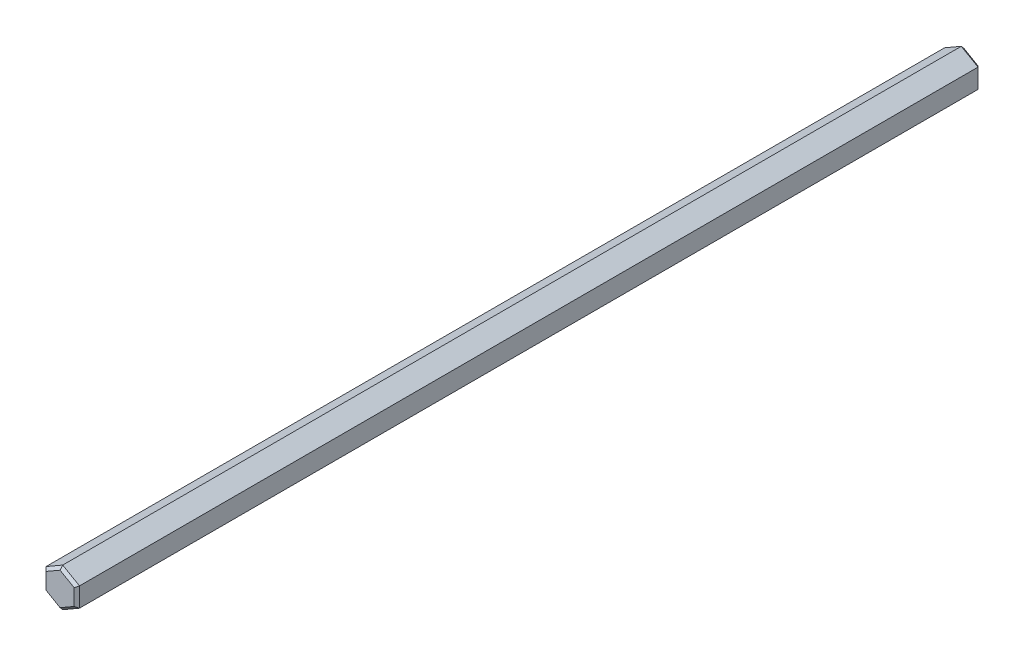
ISO-10303-21;
HEADER;
FILE_DESCRIPTION(('STEP AP214'),'2;1');
FILE_NAME('part.step','',(''),(''),'','','');
FILE_SCHEMA(('AUTOMOTIVE_DESIGN { 1 0 10303 214 1 1 1 1 }'));
ENDSEC;
DATA;
#1=APPLICATION_CONTEXT('core data for automotive mechanical design processes');
#2=APPLICATION_PROTOCOL_DEFINITION('international standard','automotive_design',2000,#1);
#3=PRODUCT_CONTEXT('',#1,'mechanical');
#4=PRODUCT('Part','Part','',(#3));
#5=PRODUCT_RELATED_PRODUCT_CATEGORY('part','',(#4));
#6=PRODUCT_DEFINITION_FORMATION('','',#4);
#7=PRODUCT_DEFINITION_CONTEXT('part definition',#1,'design');
#8=PRODUCT_DEFINITION('design','',#6,#7);
#9=PRODUCT_DEFINITION_SHAPE('','',#8);
#10=(LENGTH_UNIT() NAMED_UNIT(*) SI_UNIT(.MILLI.,.METRE.));
#11=(NAMED_UNIT(*) PLANE_ANGLE_UNIT() SI_UNIT($,.RADIAN.));
#12=(NAMED_UNIT(*) SI_UNIT($,.STERADIAN.) SOLID_ANGLE_UNIT());
#13=UNCERTAINTY_MEASURE_WITH_UNIT(LENGTH_MEASURE(1.E-05),#10,'distance_accuracy_value','');
#14=(GEOMETRIC_REPRESENTATION_CONTEXT(3) GLOBAL_UNCERTAINTY_ASSIGNED_CONTEXT((#13)) GLOBAL_UNIT_ASSIGNED_CONTEXT((#10,
#11,#12)) REPRESENTATION_CONTEXT('',''));
#15=CARTESIAN_POINT('',(0.,0.,0.));
#16=DIRECTION('',(0.,0.,1.));
#17=DIRECTION('',(1.,0.,0.));
#18=AXIS2_PLACEMENT_3D('',#15,#16,#17);
#19=CARTESIAN_POINT('',(-2.5,-1.44337567297406,-67.5));
#20=DIRECTION('',(-0.5,-0.866025403784439,0.));
#21=DIRECTION('',(0.866025403784439,-0.5,0.));
#22=AXIS2_PLACEMENT_3D('',#19,#20,#21);
#23=PLANE('',#22);
#24=DIRECTION('',(0.,0.,1.));
#25=VECTOR('',#24,1.);
#26=CARTESIAN_POINT('',(-2.5,-1.44337567297406,-67.5));
#27=LINE('',#26,#25);
#28=CARTESIAN_POINT('',(-2.5,-1.44337567297406,-67.1));
#29=VERTEX_POINT('',#28);
#30=CARTESIAN_POINT('',(-2.5,-1.44337567297406,67.1));
#31=VERTEX_POINT('',#30);
#32=EDGE_CURVE('E149',#29,#31,#27,.T.);
#33=ORIENTED_EDGE('',*,*,#32,.F.);
#34=DIRECTION('',(0.866025403784439,-0.5,0.));
#35=VECTOR('',#34,1.);
#36=CARTESIAN_POINT('',(0.,-2.88675134594813,-67.1));
#37=LINE('',#36,#35);
#38=CARTESIAN_POINT('',(0.,-2.88675134594813,-67.1));
#39=VERTEX_POINT('',#38);
#40=EDGE_CURVE('E181',#29,#39,#37,.T.);
#41=ORIENTED_EDGE('',*,*,#40,.T.);
#42=DIRECTION('',(0.,0.,1.));
#43=VECTOR('',#42,1.);
#44=CARTESIAN_POINT('',(0.,-2.88675134594813,-67.5));
#45=LINE('',#44,#43);
#46=CARTESIAN_POINT('',(0.,-2.88675134594813,67.1));
#47=VERTEX_POINT('',#46);
#48=EDGE_CURVE('E214',#39,#47,#45,.T.);
#49=ORIENTED_EDGE('',*,*,#48,.T.);
#50=DIRECTION('',(-0.866025403784439,0.5,0.));
#51=VECTOR('',#50,1.);
#52=CARTESIAN_POINT('',(-2.5,-1.44337567297406,67.1));
#53=LINE('',#52,#51);
#54=EDGE_CURVE('E179',#47,#31,#53,.T.);
#55=ORIENTED_EDGE('',*,*,#54,.T.);
#56=EDGE_LOOP('',(#33,#41,#49,#55));
#57=FACE_BOUND('',#56,.T.);
#58=ADVANCED_FACE('F32',(#57),#23,.T.);
#59=CARTESIAN_POINT('',(-2.5,1.44337567297407,-67.5));
#60=DIRECTION('',(-1.,0.,0.));
#61=DIRECTION('',(0.,0.,1.));
#62=AXIS2_PLACEMENT_3D('',#59,#60,#61);
#63=PLANE('',#62);
#64=DIRECTION('',(0.,0.,1.));
#65=VECTOR('',#64,1.);
#66=CARTESIAN_POINT('',(-2.5,1.44337567297407,-67.5));
#67=LINE('',#66,#65);
#68=CARTESIAN_POINT('',(-2.5,1.44337567297407,-67.1));
#69=VERTEX_POINT('',#68);
#70=CARTESIAN_POINT('',(-2.5,1.44337567297407,67.1));
#71=VERTEX_POINT('',#70);
#72=EDGE_CURVE('E130',#69,#71,#67,.T.);
#73=ORIENTED_EDGE('',*,*,#72,.F.);
#74=DIRECTION('',(0.,-1.,0.));
#75=VECTOR('',#74,1.);
#76=CARTESIAN_POINT('',(-2.5,-1.44337567297406,-67.1));
#77=LINE('',#76,#75);
#78=EDGE_CURVE('E145',#69,#29,#77,.T.);
#79=ORIENTED_EDGE('',*,*,#78,.T.);
#80=ORIENTED_EDGE('',*,*,#32,.T.);
#81=DIRECTION('',(0.,1.,0.));
#82=VECTOR('',#81,1.);
#83=CARTESIAN_POINT('',(-2.5,1.44337567297407,67.1));
#84=LINE('',#83,#82);
#85=EDGE_CURVE('E148',#31,#71,#84,.T.);
#86=ORIENTED_EDGE('',*,*,#85,.T.);
#87=EDGE_LOOP('',(#73,#79,#80,#86));
#88=FACE_BOUND('',#87,.T.);
#89=ADVANCED_FACE('F142',(#88),#63,.T.);
#90=CARTESIAN_POINT('',(0.,2.88675134594813,-67.5));
#91=DIRECTION('',(-0.5,0.866025403784439,0.));
#92=DIRECTION('',(-0.866025403784439,-0.5,0.));
#93=AXIS2_PLACEMENT_3D('',#90,#91,#92);
#94=PLANE('',#93);
#95=DIRECTION('',(0.,0.,1.));
#96=VECTOR('',#95,1.);
#97=CARTESIAN_POINT('',(0.,2.88675134594813,-67.5));
#98=LINE('',#97,#96);
#99=CARTESIAN_POINT('',(0.,2.88675134594813,-67.1));
#100=VERTEX_POINT('',#99);
#101=CARTESIAN_POINT('',(0.,2.88675134594813,67.1));
#102=VERTEX_POINT('',#101);
#103=EDGE_CURVE('E132',#100,#102,#98,.T.);
#104=ORIENTED_EDGE('',*,*,#103,.F.);
#105=DIRECTION('',(-0.866025403784439,-0.5,0.));
#106=VECTOR('',#105,1.);
#107=CARTESIAN_POINT('',(-2.5,1.44337567297407,-67.1));
#108=LINE('',#107,#106);
#109=EDGE_CURVE('E126',#100,#69,#108,.T.);
#110=ORIENTED_EDGE('',*,*,#109,.T.);
#111=ORIENTED_EDGE('',*,*,#72,.T.);
#112=DIRECTION('',(0.866025403784439,0.5,0.));
#113=VECTOR('',#112,1.);
#114=CARTESIAN_POINT('',(0.,2.88675134594813,67.1));
#115=LINE('',#114,#113);
#116=EDGE_CURVE('E138',#71,#102,#115,.T.);
#117=ORIENTED_EDGE('',*,*,#116,.T.);
#118=EDGE_LOOP('',(#104,#110,#111,#117));
#119=FACE_BOUND('',#118,.T.);
#120=ADVANCED_FACE('F128',(#119),#94,.T.);
#121=CARTESIAN_POINT('',(2.5,1.44337567297406,-67.5));
#122=DIRECTION('',(0.5,0.866025403784439,0.));
#123=DIRECTION('',(-0.866025403784439,0.5,0.));
#124=AXIS2_PLACEMENT_3D('',#121,#122,#123);
#125=PLANE('',#124);
#126=DIRECTION('',(0.,0.,1.));
#127=VECTOR('',#126,1.);
#128=CARTESIAN_POINT('',(2.5,1.44337567297406,-67.5));
#129=LINE('',#128,#127);
#130=CARTESIAN_POINT('',(2.5,1.44337567297406,-67.1));
#131=VERTEX_POINT('',#130);
#132=CARTESIAN_POINT('',(2.5,1.44337567297406,67.1));
#133=VERTEX_POINT('',#132);
#134=EDGE_CURVE('E248',#131,#133,#129,.T.);
#135=ORIENTED_EDGE('',*,*,#134,.F.);
#136=DIRECTION('',(-0.866025403784439,0.5,0.));
#137=VECTOR('',#136,1.);
#138=CARTESIAN_POINT('',(0.,2.88675134594813,-67.1));
#139=LINE('',#138,#137);
#140=EDGE_CURVE('E189',#131,#100,#139,.T.);
#141=ORIENTED_EDGE('',*,*,#140,.T.);
#142=ORIENTED_EDGE('',*,*,#103,.T.);
#143=DIRECTION('',(0.866025403784439,-0.5,0.));
#144=VECTOR('',#143,1.);
#145=CARTESIAN_POINT('',(2.5,1.44337567297406,67.1));
#146=LINE('',#145,#144);
#147=EDGE_CURVE('E187',#102,#133,#146,.T.);
#148=ORIENTED_EDGE('',*,*,#147,.T.);
#149=EDGE_LOOP('',(#135,#141,#142,#148));
#150=FACE_BOUND('',#149,.T.);
#151=ADVANCED_FACE('F265',(#150),#125,.T.);
#152=CARTESIAN_POINT('',(2.5,-1.44337567297406,-67.5));
#153=DIRECTION('',(1.,0.,0.));
#154=DIRECTION('',(0.,0.,-1.));
#155=AXIS2_PLACEMENT_3D('',#152,#153,#154);
#156=PLANE('',#155);
#157=DIRECTION('',(0.,0.,1.));
#158=VECTOR('',#157,1.);
#159=CARTESIAN_POINT('',(2.5,-1.44337567297406,-67.5));
#160=LINE('',#159,#158);
#161=CARTESIAN_POINT('',(2.5,-1.44337567297406,-67.1));
#162=VERTEX_POINT('',#161);
#163=CARTESIAN_POINT('',(2.5,-1.44337567297406,67.1));
#164=VERTEX_POINT('',#163);
#165=EDGE_CURVE('E246',#162,#164,#160,.T.);
#166=ORIENTED_EDGE('',*,*,#165,.F.);
#167=DIRECTION('',(0.,1.,0.));
#168=VECTOR('',#167,1.);
#169=CARTESIAN_POINT('',(2.5,1.44337567297406,-67.1));
#170=LINE('',#169,#168);
#171=EDGE_CURVE('E193',#162,#131,#170,.T.);
#172=ORIENTED_EDGE('',*,*,#171,.T.);
#173=ORIENTED_EDGE('',*,*,#134,.T.);
#174=DIRECTION('',(0.,-1.,0.));
#175=VECTOR('',#174,1.);
#176=CARTESIAN_POINT('',(2.5,-1.44337567297406,67.1));
#177=LINE('',#176,#175);
#178=EDGE_CURVE('E191',#133,#164,#177,.T.);
#179=ORIENTED_EDGE('',*,*,#178,.T.);
#180=EDGE_LOOP('',(#166,#172,#173,#179));
#181=FACE_BOUND('',#180,.T.);
#182=ADVANCED_FACE('F302',(#181),#156,.T.);
#183=CARTESIAN_POINT('',(0.,-2.88675134594813,-67.5));
#184=DIRECTION('',(0.5,-0.866025403784439,0.));
#185=DIRECTION('',(0.866025403784439,0.5,0.));
#186=AXIS2_PLACEMENT_3D('',#183,#184,#185);
#187=PLANE('',#186);
#188=ORIENTED_EDGE('',*,*,#48,.F.);
#189=DIRECTION('',(0.866025403784439,0.5,0.));
#190=VECTOR('',#189,1.);
#191=CARTESIAN_POINT('',(2.5,-1.44337567297406,-67.1));
#192=LINE('',#191,#190);
#193=EDGE_CURVE('E185',#39,#162,#192,.T.);
#194=ORIENTED_EDGE('',*,*,#193,.T.);
#195=ORIENTED_EDGE('',*,*,#165,.T.);
#196=DIRECTION('',(-0.866025403784439,-0.5,0.));
#197=VECTOR('',#196,1.);
#198=CARTESIAN_POINT('',(0.,-2.88675134594813,67.1));
#199=LINE('',#198,#197);
#200=EDGE_CURVE('E137',#164,#47,#199,.T.);
#201=ORIENTED_EDGE('',*,*,#200,.T.);
#202=EDGE_LOOP('',(#188,#194,#195,#201));
#203=FACE_BOUND('',#202,.T.);
#204=ADVANCED_FACE('F243',(#203),#187,.T.);
#205=CARTESIAN_POINT('',(0.,0.,-67.5));
#206=DIRECTION('',(0.,0.,1.));
#207=DIRECTION('',(1.,0.,0.));
#208=AXIS2_PLACEMENT_3D('',#205,#206,#207);
#209=PLANE('',#208);
#210=DIRECTION('',(-0.866025403784439,0.5,0.));
#211=VECTOR('',#210,1.);
#212=CARTESIAN_POINT('',(-2.30000000000001,-1.0969655114603,-67.5));
#213=LINE('',#212,#211);
#214=CARTESIAN_POINT('',(0.,-2.42487113059645,-67.5));
#215=VERTEX_POINT('',#214);
#216=CARTESIAN_POINT('',(-2.10000000000002,-1.21243556529822,-67.5));
#217=VERTEX_POINT('',#216);
#218=EDGE_CURVE('E175',#215,#217,#213,.T.);
#219=ORIENTED_EDGE('',*,*,#218,.T.);
#220=DIRECTION('',(0.,1.,0.));
#221=VECTOR('',#220,1.);
#222=CARTESIAN_POINT('',(-2.10000000000002,1.44337567297407,-67.5));
#223=LINE('',#222,#221);
#224=CARTESIAN_POINT('',(-2.10000000000002,1.21243556529822,-67.5));
#225=VERTEX_POINT('',#224);
#226=EDGE_CURVE('E177',#217,#225,#223,.T.);
#227=ORIENTED_EDGE('',*,*,#226,.T.);
#228=DIRECTION('',(0.866025403784439,0.5,0.));
#229=VECTOR('',#228,1.);
#230=CARTESIAN_POINT('',(0.199999999999989,2.54034118443437,-67.5));
#231=LINE('',#230,#229);
#232=CARTESIAN_POINT('',(0.,2.42487113059645,-67.5));
#233=VERTEX_POINT('',#232);
#234=EDGE_CURVE('E154',#225,#233,#231,.T.);
#235=ORIENTED_EDGE('',*,*,#234,.T.);
#236=DIRECTION('',(0.866025403784439,-0.5,0.));
#237=VECTOR('',#236,1.);
#238=CARTESIAN_POINT('',(2.30000000000001,1.0969655114603,-67.5));
#239=LINE('',#238,#237);
#240=CARTESIAN_POINT('',(2.10000000000002,1.21243556529822,-67.5));
#241=VERTEX_POINT('',#240);
#242=EDGE_CURVE('E166',#233,#241,#239,.T.);
#243=ORIENTED_EDGE('',*,*,#242,.T.);
#244=DIRECTION('',(0.,-1.,0.));
#245=VECTOR('',#244,1.);
#246=CARTESIAN_POINT('',(2.10000000000002,-1.44337567297406,-67.5));
#247=LINE('',#246,#245);
#248=CARTESIAN_POINT('',(2.10000000000002,-1.21243556529822,-67.5));
#249=VERTEX_POINT('',#248);
#250=EDGE_CURVE('E164',#241,#249,#247,.T.);
#251=ORIENTED_EDGE('',*,*,#250,.T.);
#252=DIRECTION('',(-0.866025403784439,-0.5,0.));
#253=VECTOR('',#252,1.);
#254=CARTESIAN_POINT('',(-0.199999999999992,-2.54034118443437,-67.5));
#255=LINE('',#254,#253);
#256=EDGE_CURVE('E172',#249,#215,#255,.T.);
#257=ORIENTED_EDGE('',*,*,#256,.T.);
#258=EDGE_LOOP('',(#219,#227,#235,#243,#251,#257));
#259=FACE_BOUND('',#258,.T.);
#260=ADVANCED_FACE('F273',(#259),#209,.F.);
#261=CARTESIAN_POINT('',(0.,0.,67.5));
#262=DIRECTION('',(0.,0.,1.));
#263=DIRECTION('',(1.,0.,0.));
#264=AXIS2_PLACEMENT_3D('',#261,#262,#263);
#265=PLANE('',#264);
#266=DIRECTION('',(-0.866025403784439,0.5,0.));
#267=VECTOR('',#266,1.);
#268=CARTESIAN_POINT('',(1.05000000000001,1.81865334794734,67.5));
#269=LINE('',#268,#267);
#270=CARTESIAN_POINT('',(2.10000000000003,1.21243556529823,67.5));
#271=VERTEX_POINT('',#270);
#272=CARTESIAN_POINT('',(0.,2.42487113059646,67.5));
#273=VERTEX_POINT('',#272);
#274=EDGE_CURVE('E56',#271,#273,#269,.T.);
#275=ORIENTED_EDGE('',*,*,#274,.T.);
#276=DIRECTION('',(-0.866025403784439,-0.5,0.));
#277=VECTOR('',#276,1.);
#278=CARTESIAN_POINT('',(-1.05000000000001,1.81865334794735,67.5));
#279=LINE('',#278,#277);
#280=CARTESIAN_POINT('',(-2.10000000000003,1.21243556529823,67.5));
#281=VERTEX_POINT('',#280);
#282=EDGE_CURVE('E11',#273,#281,#279,.T.);
#283=ORIENTED_EDGE('',*,*,#282,.T.);
#284=DIRECTION('',(0.,-1.,0.));
#285=VECTOR('',#284,1.);
#286=CARTESIAN_POINT('',(-2.10000000000003,0.,67.5));
#287=LINE('',#286,#285);
#288=CARTESIAN_POINT('',(-2.10000000000003,-1.21243556529823,67.5));
#289=VERTEX_POINT('',#288);
#290=EDGE_CURVE('E41',#281,#289,#287,.T.);
#291=ORIENTED_EDGE('',*,*,#290,.T.);
#292=DIRECTION('',(0.866025403784439,-0.5,0.));
#293=VECTOR('',#292,1.);
#294=CARTESIAN_POINT('',(-1.05000000000001,-1.81865334794735,67.5));
#295=LINE('',#294,#293);
#296=CARTESIAN_POINT('',(0.,-2.42487113059646,67.5));
#297=VERTEX_POINT('',#296);
#298=EDGE_CURVE('E199',#289,#297,#295,.T.);
#299=ORIENTED_EDGE('',*,*,#298,.T.);
#300=DIRECTION('',(0.866025403784439,0.5,0.));
#301=VECTOR('',#300,1.);
#302=CARTESIAN_POINT('',(1.05000000000001,-1.81865334794734,67.5));
#303=LINE('',#302,#301);
#304=CARTESIAN_POINT('',(2.10000000000003,-1.21243556529823,67.5));
#305=VERTEX_POINT('',#304);
#306=EDGE_CURVE('E195',#297,#305,#303,.T.);
#307=ORIENTED_EDGE('',*,*,#306,.T.);
#308=DIRECTION('',(0.,1.,0.));
#309=VECTOR('',#308,1.);
#310=CARTESIAN_POINT('',(2.10000000000003,0.,67.5));
#311=LINE('',#310,#309);
#312=EDGE_CURVE('E197',#305,#271,#311,.T.);
#313=ORIENTED_EDGE('',*,*,#312,.T.);
#314=EDGE_LOOP('',(#275,#283,#291,#299,#307,#313));
#315=FACE_BOUND('',#314,.T.);
#316=ADVANCED_FACE('F258',(#315),#265,.T.);
#317=CARTESIAN_POINT('',(2.5,-1.44337567297406,-67.1));
#318=DIRECTION('',(0.707106781186535,0.,-0.70710678118656));
#319=DIRECTION('',(0.,-1.,0.));
#320=AXIS2_PLACEMENT_3D('',#317,#318,#319);
#321=PLANE('',#320);
#322=DIRECTION('',(-0.654653670707987,0.377964473009233,-0.654653670707964));
#323=VECTOR('',#322,1.);
#324=CARTESIAN_POINT('',(2.5,-1.44337567297406,-67.1));
#325=LINE('',#324,#323);
#326=EDGE_CURVE('E208',#249,#162,#325,.F.);
#327=ORIENTED_EDGE('',*,*,#326,.F.);
#328=ORIENTED_EDGE('',*,*,#250,.F.);
#329=DIRECTION('',(0.654653670707987,0.377964473009233,0.654653670707964));
#330=VECTOR('',#329,1.);
#331=CARTESIAN_POINT('',(1.78571428571426,1.03098262355289,-67.8142857142857));
#332=LINE('',#331,#330);
#333=EDGE_CURVE('E211',#131,#241,#332,.F.);
#334=ORIENTED_EDGE('',*,*,#333,.F.);
#335=ORIENTED_EDGE('',*,*,#171,.F.);
#336=EDGE_LOOP('',(#327,#328,#334,#335));
#337=FACE_BOUND('',#336,.T.);
#338=ADVANCED_FACE('F276',(#337),#321,.T.);
#339=CARTESIAN_POINT('',(2.5,1.44337567297406,-67.1));
#340=DIRECTION('',(0.353553390593267,0.612372435695784,-0.70710678118656));
#341=DIRECTION('',(0.866025403784439,-0.5,0.));
#342=AXIS2_PLACEMENT_3D('',#339,#340,#341);
#343=PLANE('',#342);
#344=ORIENTED_EDGE('',*,*,#333,.T.);
#345=ORIENTED_EDGE('',*,*,#242,.F.);
#346=DIRECTION('',(0.,0.755928946018466,0.654653670707964));
#347=VECTOR('',#346,1.);
#348=CARTESIAN_POINT('',(0.,2.06196524710578,-67.8142857142857));
#349=LINE('',#348,#347);
#350=EDGE_CURVE('E206',#100,#233,#349,.F.);
#351=ORIENTED_EDGE('',*,*,#350,.F.);
#352=ORIENTED_EDGE('',*,*,#140,.F.);
#353=EDGE_LOOP('',(#344,#345,#351,#352));
#354=FACE_BOUND('',#353,.T.);
#355=ADVANCED_FACE('F269',(#354),#343,.T.);
#356=CARTESIAN_POINT('',(0.,-2.88675134594813,-67.1));
#357=DIRECTION('',(0.353553390593268,-0.612372435695784,-0.70710678118656));
#358=DIRECTION('',(-0.866025403784439,-0.5,0.));
#359=AXIS2_PLACEMENT_3D('',#356,#357,#358);
#360=PLANE('',#359);
#361=ORIENTED_EDGE('',*,*,#326,.T.);
#362=ORIENTED_EDGE('',*,*,#193,.F.);
#363=DIRECTION('',(0.,0.755928946018466,-0.654653670707964));
#364=VECTOR('',#363,1.);
#365=CARTESIAN_POINT('',(0.,-2.88675134594813,-67.1));
#366=LINE('',#365,#364);
#367=EDGE_CURVE('E158',#215,#39,#366,.F.);
#368=ORIENTED_EDGE('',*,*,#367,.F.);
#369=ORIENTED_EDGE('',*,*,#256,.F.);
#370=EDGE_LOOP('',(#361,#362,#368,#369));
#371=FACE_BOUND('',#370,.T.);
#372=ADVANCED_FACE('F281',(#371),#360,.T.);
#373=CARTESIAN_POINT('',(0.,2.88675134594813,-67.1));
#374=DIRECTION('',(-0.353553390593268,0.612372435695784,-0.70710678118656));
#375=DIRECTION('',(0.866025403784439,0.5,0.));
#376=AXIS2_PLACEMENT_3D('',#373,#374,#375);
#377=PLANE('',#376);
#378=ORIENTED_EDGE('',*,*,#350,.T.);
#379=ORIENTED_EDGE('',*,*,#234,.F.);
#380=DIRECTION('',(-0.654653670707987,0.377964473009232,0.654653670707964));
#381=VECTOR('',#380,1.);
#382=CARTESIAN_POINT('',(-1.78571428571426,1.03098262355289,-67.8142857142857));
#383=LINE('',#382,#381);
#384=EDGE_CURVE('E152',#69,#225,#383,.F.);
#385=ORIENTED_EDGE('',*,*,#384,.F.);
#386=ORIENTED_EDGE('',*,*,#109,.F.);
#387=EDGE_LOOP('',(#378,#379,#385,#386));
#388=FACE_BOUND('',#387,.T.);
#389=ADVANCED_FACE('F153',(#388),#377,.T.);
#390=CARTESIAN_POINT('',(-2.5,-1.44337567297406,-67.1));
#391=DIRECTION('',(-0.353553390593267,-0.612372435695784,-0.70710678118656));
#392=DIRECTION('',(-0.866025403784439,0.5,0.));
#393=AXIS2_PLACEMENT_3D('',#390,#391,#392);
#394=PLANE('',#393);
#395=ORIENTED_EDGE('',*,*,#367,.T.);
#396=ORIENTED_EDGE('',*,*,#40,.F.);
#397=DIRECTION('',(0.654653670707987,0.377964473009234,-0.654653670707964));
#398=VECTOR('',#397,1.);
#399=CARTESIAN_POINT('',(-2.5,-1.44337567297406,-67.1));
#400=LINE('',#399,#398);
#401=EDGE_CURVE('E159',#217,#29,#400,.F.);
#402=ORIENTED_EDGE('',*,*,#401,.F.);
#403=ORIENTED_EDGE('',*,*,#218,.F.);
#404=EDGE_LOOP('',(#395,#396,#402,#403));
#405=FACE_BOUND('',#404,.T.);
#406=ADVANCED_FACE('F284',(#405),#394,.T.);
#407=CARTESIAN_POINT('',(-2.5,1.44337567297407,-67.1));
#408=DIRECTION('',(-0.707106781186535,0.,-0.70710678118656));
#409=DIRECTION('',(0.,1.,0.));
#410=AXIS2_PLACEMENT_3D('',#407,#408,#409);
#411=PLANE('',#410);
#412=ORIENTED_EDGE('',*,*,#384,.T.);
#413=ORIENTED_EDGE('',*,*,#226,.F.);
#414=ORIENTED_EDGE('',*,*,#401,.T.);
#415=ORIENTED_EDGE('',*,*,#78,.F.);
#416=EDGE_LOOP('',(#412,#413,#414,#415));
#417=FACE_BOUND('',#416,.T.);
#418=ADVANCED_FACE('F161',(#417),#411,.T.);
#419=CARTESIAN_POINT('',(1.05000000000001,-1.81865334794734,67.5));
#420=DIRECTION('',(-0.353553390593279,0.612372435695803,-0.707106781186537));
#421=DIRECTION('',(0.866025403784439,0.5,0.));
#422=AXIS2_PLACEMENT_3D('',#419,#420,#421);
#423=PLANE('',#422);
#424=DIRECTION('',(0.,-0.755928946018445,-0.654653670707988));
#425=VECTOR('',#424,1.);
#426=CARTESIAN_POINT('',(0.,-2.07846096908269,67.8));
#427=LINE('',#426,#425);
#428=EDGE_CURVE('E223',#47,#297,#427,.F.);
#429=ORIENTED_EDGE('',*,*,#428,.F.);
#430=ORIENTED_EDGE('',*,*,#200,.F.);
#431=DIRECTION('',(-0.654653670707969,0.377964473009223,0.654653670707988));
#432=VECTOR('',#431,1.);
#433=CARTESIAN_POINT('',(1.80000000000003,-1.03923048454134,67.8));
#434=LINE('',#433,#432);
#435=EDGE_CURVE('E36',#305,#164,#434,.F.);
#436=ORIENTED_EDGE('',*,*,#435,.F.);
#437=ORIENTED_EDGE('',*,*,#306,.F.);
#438=EDGE_LOOP('',(#429,#430,#436,#437));
#439=FACE_BOUND('',#438,.T.);
#440=ADVANCED_FACE('F34',(#439),#423,.F.);
#441=CARTESIAN_POINT('',(2.10000000000003,0.,67.5));
#442=DIRECTION('',(-0.707106781186558,0.,-0.707106781186537));
#443=DIRECTION('',(0.,1.,0.));
#444=AXIS2_PLACEMENT_3D('',#441,#442,#443);
#445=PLANE('',#444);
#446=ORIENTED_EDGE('',*,*,#435,.T.);
#447=ORIENTED_EDGE('',*,*,#178,.F.);
#448=DIRECTION('',(-0.654653670707969,-0.377964473009224,0.654653670707988));
#449=VECTOR('',#448,1.);
#450=CARTESIAN_POINT('',(1.80000000000003,1.03923048454134,67.8));
#451=LINE('',#450,#449);
#452=EDGE_CURVE('E221',#271,#133,#451,.F.);
#453=ORIENTED_EDGE('',*,*,#452,.F.);
#454=ORIENTED_EDGE('',*,*,#312,.F.);
#455=EDGE_LOOP('',(#446,#447,#453,#454));
#456=FACE_BOUND('',#455,.T.);
#457=ADVANCED_FACE('F234',(#456),#445,.F.);
#458=CARTESIAN_POINT('',(-1.05000000000001,-1.81865334794735,67.5));
#459=DIRECTION('',(0.353553390593279,0.612372435695803,-0.707106781186537));
#460=DIRECTION('',(0.866025403784439,-0.5,0.));
#461=AXIS2_PLACEMENT_3D('',#458,#459,#460);
#462=PLANE('',#461);
#463=ORIENTED_EDGE('',*,*,#428,.T.);
#464=ORIENTED_EDGE('',*,*,#298,.F.);
#465=DIRECTION('',(-0.654653670707969,-0.377964473009223,-0.654653670707988));
#466=VECTOR('',#465,1.);
#467=CARTESIAN_POINT('',(-1.80000000000003,-1.03923048454134,67.8));
#468=LINE('',#467,#466);
#469=EDGE_CURVE('E218',#31,#289,#468,.F.);
#470=ORIENTED_EDGE('',*,*,#469,.F.);
#471=ORIENTED_EDGE('',*,*,#54,.F.);
#472=EDGE_LOOP('',(#463,#464,#470,#471));
#473=FACE_BOUND('',#472,.T.);
#474=ADVANCED_FACE('F255',(#473),#462,.F.);
#475=CARTESIAN_POINT('',(1.05000000000001,1.81865334794734,67.5));
#476=DIRECTION('',(-0.353553390593279,-0.612372435695803,-0.707106781186538));
#477=DIRECTION('',(-0.866025403784439,0.5,0.));
#478=AXIS2_PLACEMENT_3D('',#475,#476,#477);
#479=PLANE('',#478);
#480=ORIENTED_EDGE('',*,*,#452,.T.);
#481=ORIENTED_EDGE('',*,*,#147,.F.);
#482=DIRECTION('',(0.,-0.755928946018445,0.654653670707988));
#483=VECTOR('',#482,1.);
#484=CARTESIAN_POINT('',(0.,2.07846096908269,67.8));
#485=LINE('',#484,#483);
#486=EDGE_CURVE('E216',#273,#102,#485,.F.);
#487=ORIENTED_EDGE('',*,*,#486,.F.);
#488=ORIENTED_EDGE('',*,*,#274,.F.);
#489=EDGE_LOOP('',(#480,#481,#487,#488));
#490=FACE_BOUND('',#489,.T.);
#491=ADVANCED_FACE('F262',(#490),#479,.F.);
#492=CARTESIAN_POINT('',(-2.10000000000003,0.,67.5));
#493=DIRECTION('',(0.707106781186558,0.,-0.707106781186537));
#494=DIRECTION('',(0.,-1.,0.));
#495=AXIS2_PLACEMENT_3D('',#492,#493,#494);
#496=PLANE('',#495);
#497=ORIENTED_EDGE('',*,*,#469,.T.);
#498=ORIENTED_EDGE('',*,*,#290,.F.);
#499=DIRECTION('',(-0.654653670707969,0.377964473009223,-0.654653670707988));
#500=VECTOR('',#499,1.);
#501=CARTESIAN_POINT('',(-1.80000000000003,1.03923048454134,67.8));
#502=LINE('',#501,#500);
#503=EDGE_CURVE('E49',#71,#281,#502,.F.);
#504=ORIENTED_EDGE('',*,*,#503,.F.);
#505=ORIENTED_EDGE('',*,*,#85,.F.);
#506=EDGE_LOOP('',(#497,#498,#504,#505));
#507=FACE_BOUND('',#506,.T.);
#508=ADVANCED_FACE('F257',(#507),#496,.F.);
#509=CARTESIAN_POINT('',(-1.05000000000001,1.81865334794735,67.5));
#510=DIRECTION('',(0.353553390593279,-0.612372435695803,-0.707106781186537));
#511=DIRECTION('',(-0.866025403784439,-0.5,0.));
#512=AXIS2_PLACEMENT_3D('',#509,#510,#511);
#513=PLANE('',#512);
#514=ORIENTED_EDGE('',*,*,#486,.T.);
#515=ORIENTED_EDGE('',*,*,#116,.F.);
#516=ORIENTED_EDGE('',*,*,#503,.T.);
#517=ORIENTED_EDGE('',*,*,#282,.F.);
#518=EDGE_LOOP('',(#514,#515,#516,#517));
#519=FACE_BOUND('',#518,.T.);
#520=ADVANCED_FACE('F259',(#519),#513,.F.);
#521=CLOSED_SHELL('',(#58,#89,#120,#151,#182,#204,#260,#316,#338,#355,#372,#389,#406,#418,#440,
#457,#474,#491,#508,#520));
#522=MANIFOLD_SOLID_BREP('B2',#521);
#523=ADVANCED_BREP_SHAPE_REPRESENTATION('',(#18,#522),#14);
#524=SHAPE_DEFINITION_REPRESENTATION(#9,#523);
ENDSEC;
END-ISO-10303-21;
